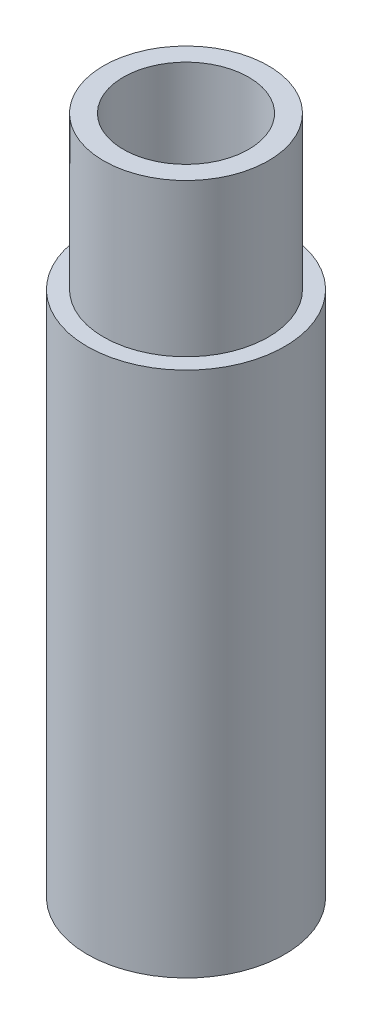
ISO-10303-21;
HEADER;
FILE_DESCRIPTION(('STEP AP214'),'2;1');
FILE_NAME('part.step','',(''),(''),'','','');
FILE_SCHEMA(('AUTOMOTIVE_DESIGN { 1 0 10303 214 1 1 1 1 }'));
ENDSEC;
DATA;
#1=APPLICATION_CONTEXT('core data for automotive mechanical design processes');
#2=APPLICATION_PROTOCOL_DEFINITION('international standard','automotive_design',2000,#1);
#3=PRODUCT_CONTEXT('',#1,'mechanical');
#4=PRODUCT('Part','Part','',(#3));
#5=PRODUCT_RELATED_PRODUCT_CATEGORY('part','',(#4));
#6=PRODUCT_DEFINITION_FORMATION('','',#4);
#7=PRODUCT_DEFINITION_CONTEXT('part definition',#1,'design');
#8=PRODUCT_DEFINITION('design','',#6,#7);
#9=PRODUCT_DEFINITION_SHAPE('','',#8);
#10=(LENGTH_UNIT() NAMED_UNIT(*) SI_UNIT(.MILLI.,.METRE.));
#11=(NAMED_UNIT(*) PLANE_ANGLE_UNIT() SI_UNIT($,.RADIAN.));
#12=(NAMED_UNIT(*) SI_UNIT($,.STERADIAN.) SOLID_ANGLE_UNIT());
#13=UNCERTAINTY_MEASURE_WITH_UNIT(LENGTH_MEASURE(1.E-05),#10,'distance_accuracy_value','');
#14=(GEOMETRIC_REPRESENTATION_CONTEXT(3) GLOBAL_UNCERTAINTY_ASSIGNED_CONTEXT((#13)) GLOBAL_UNIT_ASSIGNED_CONTEXT((#10,
#11,#12)) REPRESENTATION_CONTEXT('',''));
#15=CARTESIAN_POINT('',(0.,0.,0.));
#16=DIRECTION('',(0.,0.,1.));
#17=DIRECTION('',(1.,0.,0.));
#18=AXIS2_PLACEMENT_3D('',#15,#16,#17);
#19=CARTESIAN_POINT('',(0.,25.4,0.));
#20=DIRECTION('',(0.,1.,0.));
#21=DIRECTION('',(0.,0.,1.));
#22=AXIS2_PLACEMENT_3D('',#19,#20,#21);
#23=PLANE('',#22);
#24=CARTESIAN_POINT('',(0.,25.4,0.));
#25=DIRECTION('',(0.,1.,0.));
#26=DIRECTION('',(0.,0.,1.));
#27=AXIS2_PLACEMENT_3D('',#24,#25,#26);
#28=CIRCLE('',#27,4.7625);
#29=CARTESIAN_POINT('',(0.,25.4,4.7625));
#30=VERTEX_POINT('',#29);
#31=EDGE_CURVE('E10',#30,#30,#28,.T.);
#32=ORIENTED_EDGE('',*,*,#31,.T.);
#33=EDGE_LOOP('',(#32));
#34=FACE_BOUND('',#33,.T.);
#35=CARTESIAN_POINT('',(0.,25.4,0.));
#36=DIRECTION('',(0.,1.,0.));
#37=DIRECTION('',(0.,0.,1.));
#38=AXIS2_PLACEMENT_3D('',#35,#36,#37);
#39=CIRCLE('',#38,3.9751);
#40=CARTESIAN_POINT('',(0.,25.4,3.9751));
#41=VERTEX_POINT('',#40);
#42=EDGE_CURVE('E50',#41,#41,#39,.T.);
#43=ORIENTED_EDGE('',*,*,#42,.F.);
#44=EDGE_LOOP('',(#43));
#45=FACE_BOUND('',#44,.T.);
#46=ADVANCED_FACE('F35',(#34,#45),#23,.T.);
#47=CARTESIAN_POINT('',(0.,25.4,0.));
#48=DIRECTION('',(0.,-1.,0.));
#49=DIRECTION('',(0.,0.,-1.));
#50=AXIS2_PLACEMENT_3D('',#47,#48,#49);
#51=CYLINDRICAL_SURFACE('',#50,4.7625);
#52=ORIENTED_EDGE('',*,*,#31,.F.);
#53=EDGE_LOOP('',(#52));
#54=FACE_BOUND('',#53,.T.);
#55=CARTESIAN_POINT('',(0.,0.,0.));
#56=DIRECTION('',(0.,1.,0.));
#57=DIRECTION('',(0.,0.,1.));
#58=AXIS2_PLACEMENT_3D('',#55,#56,#57);
#59=CIRCLE('',#58,4.7625);
#60=CARTESIAN_POINT('',(0.,0.,4.7625));
#61=VERTEX_POINT('',#60);
#62=EDGE_CURVE('E43',#61,#61,#59,.T.);
#63=ORIENTED_EDGE('',*,*,#62,.T.);
#64=EDGE_LOOP('',(#63));
#65=FACE_BOUND('',#64,.T.);
#66=ADVANCED_FACE('F37',(#54,#65),#51,.T.);
#67=CARTESIAN_POINT('',(0.,0.,0.));
#68=DIRECTION('',(0.,1.,0.));
#69=DIRECTION('',(0.,0.,1.));
#70=AXIS2_PLACEMENT_3D('',#67,#68,#69);
#71=PLANE('',#70);
#72=CARTESIAN_POINT('',(0.,0.,0.));
#73=DIRECTION('',(0.,-1.,0.));
#74=DIRECTION('',(0.,0.,-1.));
#75=AXIS2_PLACEMENT_3D('',#72,#73,#74);
#76=CIRCLE('',#75,3.4544);
#77=CARTESIAN_POINT('',(0.,0.,-3.4544));
#78=VERTEX_POINT('',#77);
#79=EDGE_CURVE('E61',#78,#78,#76,.T.);
#80=ORIENTED_EDGE('',*,*,#79,.F.);
#81=EDGE_LOOP('',(#80));
#82=FACE_BOUND('',#81,.T.);
#83=ORIENTED_EDGE('',*,*,#62,.F.);
#84=EDGE_LOOP('',(#83));
#85=FACE_BOUND('',#84,.T.);
#86=ADVANCED_FACE('F67',(#82,#85),#71,.F.);
#87=CARTESIAN_POINT('',(0.,32.766,0.));
#88=DIRECTION('',(0.,-1.,0.));
#89=DIRECTION('',(0.,0.,-1.));
#90=AXIS2_PLACEMENT_3D('',#87,#88,#89);
#91=CYLINDRICAL_SURFACE('',#90,3.9751);
#92=CARTESIAN_POINT('',(0.,32.766,0.));
#93=DIRECTION('',(0.,1.,0.));
#94=DIRECTION('',(0.,0.,1.));
#95=AXIS2_PLACEMENT_3D('',#92,#93,#94);
#96=CIRCLE('',#95,3.9751);
#97=CARTESIAN_POINT('',(0.,32.766,3.9751));
#98=VERTEX_POINT('',#97);
#99=EDGE_CURVE('E48',#98,#98,#96,.T.);
#100=ORIENTED_EDGE('',*,*,#99,.F.);
#101=EDGE_LOOP('',(#100));
#102=FACE_BOUND('',#101,.T.);
#103=ORIENTED_EDGE('',*,*,#42,.T.);
#104=EDGE_LOOP('',(#103));
#105=FACE_BOUND('',#104,.T.);
#106=ADVANCED_FACE('F70',(#102,#105),#91,.T.);
#107=CARTESIAN_POINT('',(0.,32.766,0.));
#108=DIRECTION('',(0.,1.,0.));
#109=DIRECTION('',(0.,0.,1.));
#110=AXIS2_PLACEMENT_3D('',#107,#108,#109);
#111=PLANE('',#110);
#112=CARTESIAN_POINT('',(0.,32.766,0.));
#113=DIRECTION('',(0.,-1.,0.));
#114=DIRECTION('',(0.,0.,-1.));
#115=AXIS2_PLACEMENT_3D('',#112,#113,#114);
#116=CIRCLE('',#115,3.0226);
#117=CARTESIAN_POINT('',(0.,32.766,-3.0226));
#118=VERTEX_POINT('',#117);
#119=EDGE_CURVE('E53',#118,#118,#116,.T.);
#120=ORIENTED_EDGE('',*,*,#119,.T.);
#121=EDGE_LOOP('',(#120));
#122=FACE_BOUND('',#121,.T.);
#123=ORIENTED_EDGE('',*,*,#99,.T.);
#124=EDGE_LOOP('',(#123));
#125=FACE_BOUND('',#124,.T.);
#126=ADVANCED_FACE('F85',(#122,#125),#111,.T.);
#127=CARTESIAN_POINT('',(0.,32.766,0.));
#128=DIRECTION('',(0.,-1.,0.));
#129=DIRECTION('',(0.,0.,-1.));
#130=AXIS2_PLACEMENT_3D('',#127,#128,#129);
#131=CYLINDRICAL_SURFACE('',#130,3.0226);
#132=CARTESIAN_POINT('',(0.,12.9594516152961,0.));
#133=DIRECTION('',(0.,-1.,0.));
#134=DIRECTION('',(0.,0.,-1.));
#135=AXIS2_PLACEMENT_3D('',#132,#133,#134);
#136=CIRCLE('',#135,3.0226);
#137=CARTESIAN_POINT('',(0.,12.9594516152961,-3.0226));
#138=VERTEX_POINT('',#137);
#139=EDGE_CURVE('E39',#138,#138,#136,.T.);
#140=ORIENTED_EDGE('',*,*,#139,.T.);
#141=EDGE_LOOP('',(#140));
#142=FACE_BOUND('',#141,.T.);
#143=ORIENTED_EDGE('',*,*,#119,.F.);
#144=EDGE_LOOP('',(#143));
#145=FACE_BOUND('',#144,.T.);
#146=ADVANCED_FACE('F89',(#142,#145),#131,.F.);
#147=CARTESIAN_POINT('',(0.,12.7,0.));
#148=DIRECTION('',(0.,-1.,0.));
#149=DIRECTION('',(0.,0.,-1.));
#150=AXIS2_PLACEMENT_3D('',#147,#148,#149);
#151=CONICAL_SURFACE('',#150,3.4544,1.02974425867665);
#152=CARTESIAN_POINT('',(0.,12.7,0.));
#153=DIRECTION('',(0.,-1.,0.));
#154=DIRECTION('',(0.,0.,-1.));
#155=AXIS2_PLACEMENT_3D('',#152,#153,#154);
#156=CIRCLE('',#155,3.4544);
#157=CARTESIAN_POINT('',(0.,12.7,-3.4544));
#158=VERTEX_POINT('',#157);
#159=EDGE_CURVE('E58',#158,#158,#156,.T.);
#160=ORIENTED_EDGE('',*,*,#159,.T.);
#161=EDGE_LOOP('',(#160));
#162=FACE_BOUND('',#161,.T.);
#163=ORIENTED_EDGE('',*,*,#139,.F.);
#164=EDGE_LOOP('',(#163));
#165=FACE_BOUND('',#164,.T.);
#166=ADVANCED_FACE('F93',(#162,#165),#151,.F.);
#167=CARTESIAN_POINT('',(0.,0.,0.));
#168=DIRECTION('',(0.,-1.,0.));
#169=DIRECTION('',(0.,0.,-1.));
#170=AXIS2_PLACEMENT_3D('',#167,#168,#169);
#171=CYLINDRICAL_SURFACE('',#170,3.4544);
#172=ORIENTED_EDGE('',*,*,#159,.F.);
#173=EDGE_LOOP('',(#172));
#174=FACE_BOUND('',#173,.T.);
#175=ORIENTED_EDGE('',*,*,#79,.T.);
#176=EDGE_LOOP('',(#175));
#177=FACE_BOUND('',#176,.T.);
#178=ADVANCED_FACE('F65',(#174,#177),#171,.F.);
#179=CLOSED_SHELL('',(#46,#66,#86,#106,#126,#146,#166,#178));
#180=MANIFOLD_SOLID_BREP('B2',#179);
#181=ADVANCED_BREP_SHAPE_REPRESENTATION('',(#18,#180),#14);
#182=SHAPE_DEFINITION_REPRESENTATION(#9,#181);
ENDSEC;
END-ISO-10303-21;
